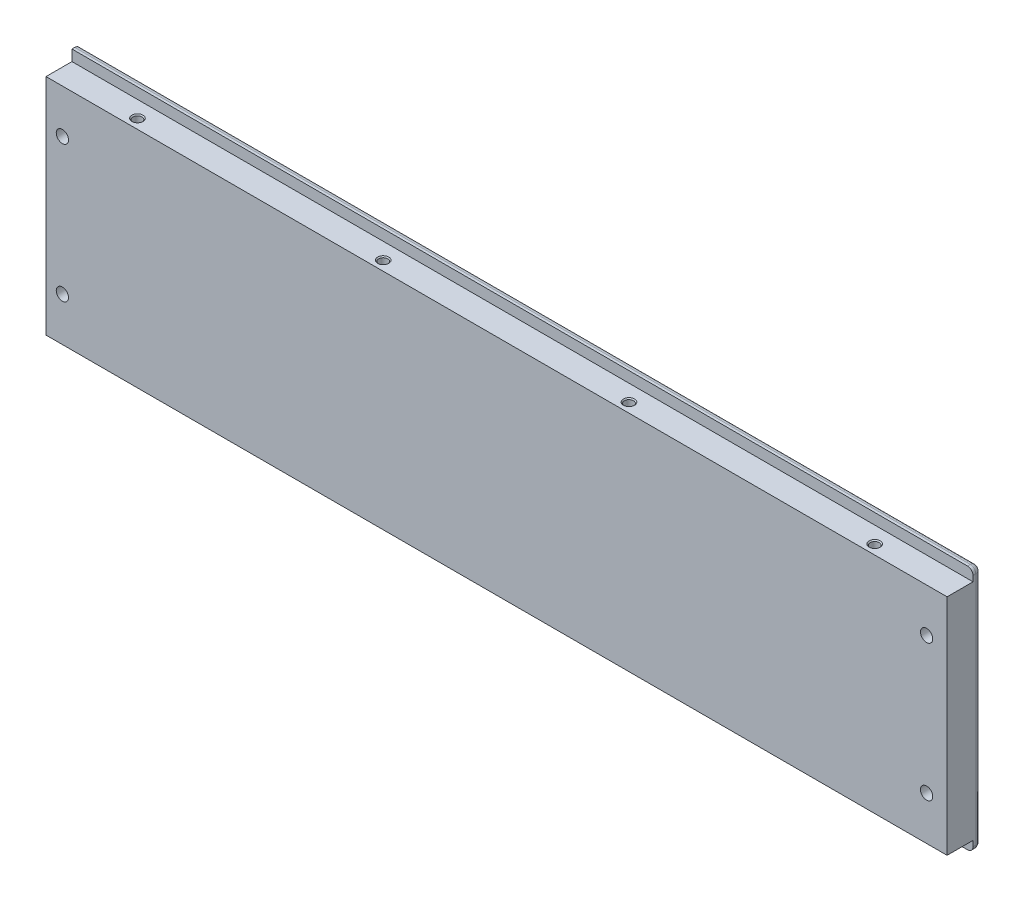
ISO-10303-21;
HEADER;
FILE_DESCRIPTION(('STEP AP214'),'2;1');
FILE_NAME('part.step','',(''),(''),'','','');
FILE_SCHEMA(('AUTOMOTIVE_DESIGN { 1 0 10303 214 1 1 1 1 }'));
ENDSEC;
DATA;
#1=APPLICATION_CONTEXT('core data for automotive mechanical design processes');
#2=APPLICATION_PROTOCOL_DEFINITION('international standard','automotive_design',2000,#1);
#3=PRODUCT_CONTEXT('',#1,'mechanical');
#4=PRODUCT('Part','Part','',(#3));
#5=PRODUCT_RELATED_PRODUCT_CATEGORY('part','',(#4));
#6=PRODUCT_DEFINITION_FORMATION('','',#4);
#7=PRODUCT_DEFINITION_CONTEXT('part definition',#1,'design');
#8=PRODUCT_DEFINITION('design','',#6,#7);
#9=PRODUCT_DEFINITION_SHAPE('','',#8);
#10=(LENGTH_UNIT() NAMED_UNIT(*) SI_UNIT(.MILLI.,.METRE.));
#11=(NAMED_UNIT(*) PLANE_ANGLE_UNIT() SI_UNIT($,.RADIAN.));
#12=(NAMED_UNIT(*) SI_UNIT($,.STERADIAN.) SOLID_ANGLE_UNIT());
#13=UNCERTAINTY_MEASURE_WITH_UNIT(LENGTH_MEASURE(1.E-05),#10,'distance_accuracy_value','');
#14=(GEOMETRIC_REPRESENTATION_CONTEXT(3) GLOBAL_UNCERTAINTY_ASSIGNED_CONTEXT((#13)) GLOBAL_UNIT_ASSIGNED_CONTEXT((#10,
#11,#12)) REPRESENTATION_CONTEXT('',''));
#15=CARTESIAN_POINT('',(0.,0.,0.));
#16=DIRECTION('',(0.,0.,1.));
#17=DIRECTION('',(1.,0.,0.));
#18=AXIS2_PLACEMENT_3D('',#15,#16,#17);
#19=CARTESIAN_POINT('',(330.,86.,12.5));
#20=DIRECTION('',(0.,-1.,0.));
#21=DIRECTION('',(0.,0.,-1.));
#22=AXIS2_PLACEMENT_3D('',#19,#20,#21);
#23=PLANE('',#22);
#24=CARTESIAN_POINT('',(30.,86.,9.));
#25=DIRECTION('',(0.,1.,0.));
#26=DIRECTION('',(0.,0.,1.));
#27=AXIS2_PLACEMENT_3D('',#24,#25,#26);
#28=CIRCLE('',#27,2.025);
#29=CARTESIAN_POINT('',(30.,86.,11.025));
#30=VERTEX_POINT('',#29);
#31=EDGE_CURVE('E251',#30,#30,#28,.T.);
#32=ORIENTED_EDGE('',*,*,#31,.F.);
#33=EDGE_LOOP('',(#32));
#34=FACE_BOUND('',#33,.T.);
#35=CARTESIAN_POINT('',(120.,86.,9.));
#36=DIRECTION('',(0.,1.,0.));
#37=DIRECTION('',(0.,0.,1.));
#38=AXIS2_PLACEMENT_3D('',#35,#36,#37);
#39=CIRCLE('',#38,2.025);
#40=CARTESIAN_POINT('',(120.,86.,11.025));
#41=VERTEX_POINT('',#40);
#42=EDGE_CURVE('E212',#41,#41,#39,.T.);
#43=ORIENTED_EDGE('',*,*,#42,.F.);
#44=EDGE_LOOP('',(#43));
#45=FACE_BOUND('',#44,.T.);
#46=DIRECTION('',(0.,0.,1.));
#47=VECTOR('',#46,1.);
#48=CARTESIAN_POINT('',(0.,86.,12.5));
#49=LINE('',#48,#47);
#50=CARTESIAN_POINT('',(0.,86.,3.));
#51=VERTEX_POINT('',#50);
#52=CARTESIAN_POINT('',(0.,86.,12.5));
#53=VERTEX_POINT('',#52);
#54=EDGE_CURVE('E171',#51,#53,#49,.T.);
#55=ORIENTED_EDGE('',*,*,#54,.T.);
#56=DIRECTION('',(-1.,0.,0.));
#57=VECTOR('',#56,1.);
#58=CARTESIAN_POINT('',(330.,86.,12.5));
#59=LINE('',#58,#57);
#60=CARTESIAN_POINT('',(330.,86.,12.5));
#61=VERTEX_POINT('',#60);
#62=EDGE_CURVE('E177',#61,#53,#59,.T.);
#63=ORIENTED_EDGE('',*,*,#62,.F.);
#64=DIRECTION('',(0.,0.,1.));
#65=VECTOR('',#64,1.);
#66=CARTESIAN_POINT('',(330.,86.,12.5));
#67=LINE('',#66,#65);
#68=CARTESIAN_POINT('',(330.,86.,3.));
#69=VERTEX_POINT('',#68);
#70=EDGE_CURVE('E170',#69,#61,#67,.T.);
#71=ORIENTED_EDGE('',*,*,#70,.F.);
#72=DIRECTION('',(-1.,0.,0.));
#73=VECTOR('',#72,1.);
#74=CARTESIAN_POINT('',(330.,86.,3.));
#75=LINE('',#74,#73);
#76=EDGE_CURVE('E181',#69,#51,#75,.T.);
#77=ORIENTED_EDGE('',*,*,#76,.T.);
#78=EDGE_LOOP('',(#55,#63,#71,#77));
#79=FACE_BOUND('',#78,.T.);
#80=CARTESIAN_POINT('',(300.,86.,9.));
#81=DIRECTION('',(0.,1.,0.));
#82=DIRECTION('',(0.,0.,1.));
#83=AXIS2_PLACEMENT_3D('',#80,#81,#82);
#84=CIRCLE('',#83,2.025);
#85=CARTESIAN_POINT('',(300.,86.,11.025));
#86=VERTEX_POINT('',#85);
#87=EDGE_CURVE('E202',#86,#86,#84,.T.);
#88=ORIENTED_EDGE('',*,*,#87,.F.);
#89=EDGE_LOOP('',(#88));
#90=FACE_BOUND('',#89,.T.);
#91=CARTESIAN_POINT('',(210.,86.,9.));
#92=DIRECTION('',(0.,1.,0.));
#93=DIRECTION('',(0.,0.,1.));
#94=AXIS2_PLACEMENT_3D('',#91,#92,#93);
#95=CIRCLE('',#94,2.025);
#96=CARTESIAN_POINT('',(210.,86.,11.025));
#97=VERTEX_POINT('',#96);
#98=EDGE_CURVE('E207',#97,#97,#95,.T.);
#99=ORIENTED_EDGE('',*,*,#98,.F.);
#100=EDGE_LOOP('',(#99));
#101=FACE_BOUND('',#100,.T.);
#102=ADVANCED_FACE('F36',(#34,#45,#79,#90,#101),#23,.F.);
#103=CARTESIAN_POINT('',(0.,0.,12.5));
#104=DIRECTION('',(1.,0.,0.));
#105=DIRECTION('',(0.,0.,-1.));
#106=AXIS2_PLACEMENT_3D('',#103,#104,#105);
#107=PLANE('',#106);
#108=DIRECTION('',(0.,0.,-1.));
#109=VECTOR('',#108,1.);
#110=CARTESIAN_POINT('',(0.,90.,12.5));
#111=LINE('',#110,#109);
#112=CARTESIAN_POINT('',(0.,90.,3.));
#113=VERTEX_POINT('',#112);
#114=CARTESIAN_POINT('',(0.,90.,2.));
#115=VERTEX_POINT('',#114);
#116=EDGE_CURVE('E188',#113,#115,#111,.T.);
#117=ORIENTED_EDGE('',*,*,#116,.T.);
#118=CARTESIAN_POINT('',(0.,88.,2.));
#119=DIRECTION('',(1.,0.,0.));
#120=DIRECTION('',(0.,0.,-1.));
#121=AXIS2_PLACEMENT_3D('',#118,#119,#120);
#122=CIRCLE('',#121,2.);
#123=CARTESIAN_POINT('',(0.,88.,0.));
#124=VERTEX_POINT('',#123);
#125=EDGE_CURVE('E45',#115,#124,#122,.F.);
#126=ORIENTED_EDGE('',*,*,#125,.T.);
#127=DIRECTION('',(0.,-1.,0.));
#128=VECTOR('',#127,1.);
#129=CARTESIAN_POINT('',(0.,0.,0.));
#130=LINE('',#129,#128);
#131=CARTESIAN_POINT('',(0.,2.,0.));
#132=VERTEX_POINT('',#131);
#133=EDGE_CURVE('E180',#124,#132,#130,.T.);
#134=ORIENTED_EDGE('',*,*,#133,.T.);
#135=CARTESIAN_POINT('',(0.,2.,2.));
#136=DIRECTION('',(1.,0.,0.));
#137=DIRECTION('',(0.,0.,-1.));
#138=AXIS2_PLACEMENT_3D('',#135,#136,#137);
#139=CIRCLE('',#138,2.);
#140=CARTESIAN_POINT('',(0.,0.,2.));
#141=VERTEX_POINT('',#140);
#142=EDGE_CURVE('E53',#132,#141,#139,.F.);
#143=ORIENTED_EDGE('',*,*,#142,.T.);
#144=DIRECTION('',(0.,0.,-1.));
#145=VECTOR('',#144,1.);
#146=CARTESIAN_POINT('',(0.,0.,12.5));
#147=LINE('',#146,#145);
#148=CARTESIAN_POINT('',(0.,0.,3.));
#149=VERTEX_POINT('',#148);
#150=EDGE_CURVE('E191',#149,#141,#147,.T.);
#151=ORIENTED_EDGE('',*,*,#150,.F.);
#152=DIRECTION('',(0.,-1.,0.));
#153=VECTOR('',#152,1.);
#154=CARTESIAN_POINT('',(0.,0.,3.));
#155=LINE('',#154,#153);
#156=CARTESIAN_POINT('',(0.,4.,3.));
#157=VERTEX_POINT('',#156);
#158=EDGE_CURVE('E157',#157,#149,#155,.T.);
#159=ORIENTED_EDGE('',*,*,#158,.F.);
#160=DIRECTION('',(0.,0.,-1.));
#161=VECTOR('',#160,1.);
#162=CARTESIAN_POINT('',(0.,4.,12.5));
#163=LINE('',#162,#161);
#164=CARTESIAN_POINT('',(0.,4.,12.5));
#165=VERTEX_POINT('',#164);
#166=EDGE_CURVE('E136',#165,#157,#163,.T.);
#167=ORIENTED_EDGE('',*,*,#166,.F.);
#168=DIRECTION('',(0.,-1.,0.));
#169=VECTOR('',#168,1.);
#170=CARTESIAN_POINT('',(0.,0.,12.5));
#171=LINE('',#170,#169);
#172=EDGE_CURVE('E184',#53,#165,#171,.T.);
#173=ORIENTED_EDGE('',*,*,#172,.F.);
#174=ORIENTED_EDGE('',*,*,#54,.F.);
#175=DIRECTION('',(0.,-1.,0.));
#176=VECTOR('',#175,1.);
#177=CARTESIAN_POINT('',(0.,90.,3.));
#178=LINE('',#177,#176);
#179=EDGE_CURVE('E165',#113,#51,#178,.T.);
#180=ORIENTED_EDGE('',*,*,#179,.F.);
#181=EDGE_LOOP('',(#117,#126,#134,#143,#151,#159,#167,#173,#174,#180));
#182=FACE_BOUND('',#181,.T.);
#183=ADVANCED_FACE('F327',(#182),#107,.F.);
#184=CARTESIAN_POINT('',(0.,0.,12.5));
#185=DIRECTION('',(0.,1.,0.));
#186=DIRECTION('',(0.,0.,1.));
#187=AXIS2_PLACEMENT_3D('',#184,#185,#186);
#188=PLANE('',#187);
#189=ORIENTED_EDGE('',*,*,#150,.T.);
#190=DIRECTION('',(1.,0.,0.));
#191=VECTOR('',#190,1.);
#192=CARTESIAN_POINT('',(328.,0.,2.));
#193=LINE('',#192,#191);
#194=CARTESIAN_POINT('',(328.,0.,2.));
#195=VERTEX_POINT('',#194);
#196=EDGE_CURVE('E11',#141,#195,#193,.T.);
#197=ORIENTED_EDGE('',*,*,#196,.T.);
#198=DIRECTION('',(0.,0.,-1.));
#199=VECTOR('',#198,1.);
#200=CARTESIAN_POINT('',(328.,0.,12.5));
#201=LINE('',#200,#199);
#202=CARTESIAN_POINT('',(328.,0.,3.));
#203=VERTEX_POINT('',#202);
#204=EDGE_CURVE('E221',#195,#203,#201,.F.);
#205=ORIENTED_EDGE('',*,*,#204,.T.);
#206=DIRECTION('',(-1.,0.,0.));
#207=VECTOR('',#206,1.);
#208=CARTESIAN_POINT('',(330.,0.,3.));
#209=LINE('',#208,#207);
#210=EDGE_CURVE('E140',#203,#149,#209,.T.);
#211=ORIENTED_EDGE('',*,*,#210,.T.);
#212=EDGE_LOOP('',(#189,#197,#205,#211));
#213=FACE_BOUND('',#212,.T.);
#214=ADVANCED_FACE('F333',(#213),#188,.F.);
#215=CARTESIAN_POINT('',(330.,0.,12.5));
#216=DIRECTION('',(-1.,0.,0.));
#217=DIRECTION('',(0.,0.,1.));
#218=AXIS2_PLACEMENT_3D('',#215,#216,#217);
#219=PLANE('',#218);
#220=DIRECTION('',(0.,0.,-1.));
#221=VECTOR('',#220,1.);
#222=CARTESIAN_POINT('',(330.,2.,12.5));
#223=LINE('',#222,#221);
#224=CARTESIAN_POINT('',(330.,2.,3.));
#225=VERTEX_POINT('',#224);
#226=CARTESIAN_POINT('',(330.,2.,2.));
#227=VERTEX_POINT('',#226);
#228=EDGE_CURVE('E215',#225,#227,#223,.T.);
#229=ORIENTED_EDGE('',*,*,#228,.T.);
#230=DIRECTION('',(0.,1.,0.));
#231=VECTOR('',#230,1.);
#232=CARTESIAN_POINT('',(330.,88.,2.));
#233=LINE('',#232,#231);
#234=CARTESIAN_POINT('',(330.,88.,2.));
#235=VERTEX_POINT('',#234);
#236=EDGE_CURVE('E227',#227,#235,#233,.T.);
#237=ORIENTED_EDGE('',*,*,#236,.T.);
#238=DIRECTION('',(0.,0.,-1.));
#239=VECTOR('',#238,1.);
#240=CARTESIAN_POINT('',(330.,88.,12.5));
#241=LINE('',#240,#239);
#242=CARTESIAN_POINT('',(330.,88.,3.));
#243=VERTEX_POINT('',#242);
#244=EDGE_CURVE('E217',#235,#243,#241,.F.);
#245=ORIENTED_EDGE('',*,*,#244,.T.);
#246=DIRECTION('',(0.,-1.,0.));
#247=VECTOR('',#246,1.);
#248=CARTESIAN_POINT('',(330.,90.,3.));
#249=LINE('',#248,#247);
#250=EDGE_CURVE('E168',#243,#69,#249,.T.);
#251=ORIENTED_EDGE('',*,*,#250,.T.);
#252=ORIENTED_EDGE('',*,*,#70,.T.);
#253=DIRECTION('',(0.,1.,0.));
#254=VECTOR('',#253,1.);
#255=CARTESIAN_POINT('',(330.,0.,12.5));
#256=LINE('',#255,#254);
#257=CARTESIAN_POINT('',(330.,4.,12.5));
#258=VERTEX_POINT('',#257);
#259=EDGE_CURVE('E156',#258,#61,#256,.T.);
#260=ORIENTED_EDGE('',*,*,#259,.F.);
#261=DIRECTION('',(0.,0.,-1.));
#262=VECTOR('',#261,1.);
#263=CARTESIAN_POINT('',(330.,4.,12.5));
#264=LINE('',#263,#262);
#265=CARTESIAN_POINT('',(330.,4.,3.));
#266=VERTEX_POINT('',#265);
#267=EDGE_CURVE('E133',#258,#266,#264,.T.);
#268=ORIENTED_EDGE('',*,*,#267,.T.);
#269=DIRECTION('',(0.,-1.,0.));
#270=VECTOR('',#269,1.);
#271=CARTESIAN_POINT('',(330.,0.,3.));
#272=LINE('',#271,#270);
#273=EDGE_CURVE('E144',#266,#225,#272,.T.);
#274=ORIENTED_EDGE('',*,*,#273,.T.);
#275=EDGE_LOOP('',(#229,#237,#245,#251,#252,#260,#268,#274));
#276=FACE_BOUND('',#275,.T.);
#277=ADVANCED_FACE('F154',(#276),#219,.F.);
#278=CARTESIAN_POINT('',(0.,90.,12.5));
#279=DIRECTION('',(0.,-1.,0.));
#280=DIRECTION('',(0.,0.,-1.));
#281=AXIS2_PLACEMENT_3D('',#278,#279,#280);
#282=PLANE('',#281);
#283=DIRECTION('',(0.,0.,-1.));
#284=VECTOR('',#283,1.);
#285=CARTESIAN_POINT('',(328.,90.,12.5));
#286=LINE('',#285,#284);
#287=CARTESIAN_POINT('',(328.,90.,3.));
#288=VERTEX_POINT('',#287);
#289=CARTESIAN_POINT('',(328.,90.,2.));
#290=VERTEX_POINT('',#289);
#291=EDGE_CURVE('E193',#288,#290,#286,.T.);
#292=ORIENTED_EDGE('',*,*,#291,.T.);
#293=DIRECTION('',(-1.,0.,0.));
#294=VECTOR('',#293,1.);
#295=CARTESIAN_POINT('',(0.,90.,2.));
#296=LINE('',#295,#294);
#297=EDGE_CURVE('E61',#290,#115,#296,.T.);
#298=ORIENTED_EDGE('',*,*,#297,.T.);
#299=ORIENTED_EDGE('',*,*,#116,.F.);
#300=DIRECTION('',(-1.,0.,0.));
#301=VECTOR('',#300,1.);
#302=CARTESIAN_POINT('',(330.,90.,3.));
#303=LINE('',#302,#301);
#304=EDGE_CURVE('E173',#288,#113,#303,.T.);
#305=ORIENTED_EDGE('',*,*,#304,.F.);
#306=EDGE_LOOP('',(#292,#298,#299,#305));
#307=FACE_BOUND('',#306,.T.);
#308=ADVANCED_FACE('F344',(#307),#282,.F.);
#309=CARTESIAN_POINT('',(0.,0.,12.5));
#310=DIRECTION('',(0.,0.,-1.));
#311=DIRECTION('',(-1.,0.,0.));
#312=AXIS2_PLACEMENT_3D('',#309,#310,#311);
#313=PLANE('',#312);
#314=CARTESIAN_POINT('',(322.5,70.,12.5));
#315=DIRECTION('',(0.,0.,-1.));
#316=DIRECTION('',(-1.,0.,0.));
#317=AXIS2_PLACEMENT_3D('',#314,#315,#316);
#318=CIRCLE('',#317,2.24999999999997);
#319=CARTESIAN_POINT('',(320.25,70.,12.5));
#320=VERTEX_POINT('',#319);
#321=EDGE_CURVE('E279',#320,#320,#318,.T.);
#322=ORIENTED_EDGE('',*,*,#321,.T.);
#323=EDGE_LOOP('',(#322));
#324=FACE_BOUND('',#323,.T.);
#325=CARTESIAN_POINT('',(322.5,20.,12.5));
#326=DIRECTION('',(0.,0.,-1.));
#327=DIRECTION('',(-1.,0.,0.));
#328=AXIS2_PLACEMENT_3D('',#325,#326,#327);
#329=CIRCLE('',#328,2.24999999999997);
#330=CARTESIAN_POINT('',(320.25,20.,12.5));
#331=VERTEX_POINT('',#330);
#332=EDGE_CURVE('E288',#331,#331,#329,.T.);
#333=ORIENTED_EDGE('',*,*,#332,.T.);
#334=EDGE_LOOP('',(#333));
#335=FACE_BOUND('',#334,.T.);
#336=CARTESIAN_POINT('',(6.,70.,12.5));
#337=DIRECTION('',(0.,0.,-1.));
#338=DIRECTION('',(-1.,0.,0.));
#339=AXIS2_PLACEMENT_3D('',#336,#337,#338);
#340=CIRCLE('',#339,2.25);
#341=CARTESIAN_POINT('',(3.75,70.,12.5));
#342=VERTEX_POINT('',#341);
#343=EDGE_CURVE('E297',#342,#342,#340,.T.);
#344=ORIENTED_EDGE('',*,*,#343,.T.);
#345=EDGE_LOOP('',(#344));
#346=FACE_BOUND('',#345,.T.);
#347=CARTESIAN_POINT('',(6.,20.,12.5));
#348=DIRECTION('',(0.,0.,-1.));
#349=DIRECTION('',(-1.,0.,0.));
#350=AXIS2_PLACEMENT_3D('',#347,#348,#349);
#351=CIRCLE('',#350,2.25);
#352=CARTESIAN_POINT('',(3.75,20.,12.5));
#353=VERTEX_POINT('',#352);
#354=EDGE_CURVE('E161',#353,#353,#351,.T.);
#355=ORIENTED_EDGE('',*,*,#354,.T.);
#356=EDGE_LOOP('',(#355));
#357=FACE_BOUND('',#356,.T.);
#358=ORIENTED_EDGE('',*,*,#172,.T.);
#359=DIRECTION('',(-1.,0.,0.));
#360=VECTOR('',#359,1.);
#361=CARTESIAN_POINT('',(330.,4.,12.5));
#362=LINE('',#361,#360);
#363=EDGE_CURVE('E141',#258,#165,#362,.T.);
#364=ORIENTED_EDGE('',*,*,#363,.F.);
#365=ORIENTED_EDGE('',*,*,#259,.T.);
#366=ORIENTED_EDGE('',*,*,#62,.T.);
#367=EDGE_LOOP('',(#358,#364,#365,#366));
#368=FACE_BOUND('',#367,.T.);
#369=ADVANCED_FACE('F309',(#324,#335,#346,#357,#368),#313,.F.);
#370=CARTESIAN_POINT('',(0.,0.,0.));
#371=DIRECTION('',(0.,0.,-1.));
#372=DIRECTION('',(-1.,0.,0.));
#373=AXIS2_PLACEMENT_3D('',#370,#371,#372);
#374=PLANE('',#373);
#375=CARTESIAN_POINT('',(322.5,70.,0.));
#376=DIRECTION('',(0.,0.,-1.));
#377=DIRECTION('',(-1.,0.,0.));
#378=AXIS2_PLACEMENT_3D('',#375,#376,#377);
#379=CIRCLE('',#378,4.47999999999998);
#380=CARTESIAN_POINT('',(318.02,70.,0.));
#381=VERTEX_POINT('',#380);
#382=EDGE_CURVE('E197',#381,#381,#379,.T.);
#383=ORIENTED_EDGE('',*,*,#382,.F.);
#384=EDGE_LOOP('',(#383));
#385=FACE_BOUND('',#384,.T.);
#386=CARTESIAN_POINT('',(322.5,20.,0.));
#387=DIRECTION('',(0.,0.,-1.));
#388=DIRECTION('',(-1.,0.,0.));
#389=AXIS2_PLACEMENT_3D('',#386,#387,#388);
#390=CIRCLE('',#389,4.47999999999998);
#391=CARTESIAN_POINT('',(318.02,20.,0.));
#392=VERTEX_POINT('',#391);
#393=EDGE_CURVE('E282',#392,#392,#390,.T.);
#394=ORIENTED_EDGE('',*,*,#393,.F.);
#395=EDGE_LOOP('',(#394));
#396=FACE_BOUND('',#395,.T.);
#397=CARTESIAN_POINT('',(6.,70.,0.));
#398=DIRECTION('',(0.,0.,-1.));
#399=DIRECTION('',(-1.,0.,0.));
#400=AXIS2_PLACEMENT_3D('',#397,#398,#399);
#401=CIRCLE('',#400,4.48);
#402=CARTESIAN_POINT('',(1.52,70.,0.));
#403=VERTEX_POINT('',#402);
#404=EDGE_CURVE('E291',#403,#403,#401,.T.);
#405=ORIENTED_EDGE('',*,*,#404,.F.);
#406=EDGE_LOOP('',(#405));
#407=FACE_BOUND('',#406,.T.);
#408=CARTESIAN_POINT('',(6.,20.,0.));
#409=DIRECTION('',(0.,0.,-1.));
#410=DIRECTION('',(-1.,0.,0.));
#411=AXIS2_PLACEMENT_3D('',#408,#409,#410);
#412=CIRCLE('',#411,4.48);
#413=CARTESIAN_POINT('',(1.52,20.,0.));
#414=VERTEX_POINT('',#413);
#415=EDGE_CURVE('E300',#414,#414,#412,.T.);
#416=ORIENTED_EDGE('',*,*,#415,.F.);
#417=EDGE_LOOP('',(#416));
#418=FACE_BOUND('',#417,.T.);
#419=ORIENTED_EDGE('',*,*,#133,.F.);
#420=DIRECTION('',(-1.,0.,0.));
#421=VECTOR('',#420,1.);
#422=CARTESIAN_POINT('',(328.,88.,0.));
#423=LINE('',#422,#421);
#424=CARTESIAN_POINT('',(328.,88.,0.));
#425=VERTEX_POINT('',#424);
#426=EDGE_CURVE('E233',#124,#425,#423,.F.);
#427=ORIENTED_EDGE('',*,*,#426,.T.);
#428=DIRECTION('',(0.,1.,0.));
#429=VECTOR('',#428,1.);
#430=CARTESIAN_POINT('',(328.,2.,0.));
#431=LINE('',#430,#429);
#432=CARTESIAN_POINT('',(328.,2.,0.));
#433=VERTEX_POINT('',#432);
#434=EDGE_CURVE('E231',#425,#433,#431,.F.);
#435=ORIENTED_EDGE('',*,*,#434,.T.);
#436=DIRECTION('',(1.,0.,0.));
#437=VECTOR('',#436,1.);
#438=CARTESIAN_POINT('',(0.,2.,0.));
#439=LINE('',#438,#437);
#440=EDGE_CURVE('E229',#433,#132,#439,.F.);
#441=ORIENTED_EDGE('',*,*,#440,.T.);
#442=EDGE_LOOP('',(#419,#427,#435,#441));
#443=FACE_BOUND('',#442,.T.);
#444=ADVANCED_FACE('F340',(#385,#396,#407,#418,#443),#374,.T.);
#445=CARTESIAN_POINT('',(330.,90.,3.));
#446=DIRECTION('',(0.,0.,-1.));
#447=DIRECTION('',(-1.,0.,0.));
#448=AXIS2_PLACEMENT_3D('',#445,#446,#447);
#449=PLANE('',#448);
#450=ORIENTED_EDGE('',*,*,#250,.F.);
#451=CARTESIAN_POINT('',(328.,88.,3.));
#452=DIRECTION('',(0.,0.,-1.));
#453=DIRECTION('',(-1.,0.,0.));
#454=AXIS2_PLACEMENT_3D('',#451,#452,#453);
#455=CIRCLE('',#454,2.);
#456=EDGE_CURVE('E219',#243,#288,#455,.F.);
#457=ORIENTED_EDGE('',*,*,#456,.T.);
#458=ORIENTED_EDGE('',*,*,#304,.T.);
#459=ORIENTED_EDGE('',*,*,#179,.T.);
#460=ORIENTED_EDGE('',*,*,#76,.F.);
#461=EDGE_LOOP('',(#450,#457,#458,#459,#460));
#462=FACE_BOUND('',#461,.T.);
#463=ADVANCED_FACE('F337',(#462),#449,.F.);
#464=CARTESIAN_POINT('',(330.,0.,3.));
#465=DIRECTION('',(0.,0.,-1.));
#466=DIRECTION('',(-1.,0.,0.));
#467=AXIS2_PLACEMENT_3D('',#464,#465,#466);
#468=PLANE('',#467);
#469=ORIENTED_EDGE('',*,*,#210,.F.);
#470=CARTESIAN_POINT('',(328.,2.,3.));
#471=DIRECTION('',(0.,0.,-1.));
#472=DIRECTION('',(-1.,0.,0.));
#473=AXIS2_PLACEMENT_3D('',#470,#471,#472);
#474=CIRCLE('',#473,2.);
#475=EDGE_CURVE('E148',#203,#225,#474,.F.);
#476=ORIENTED_EDGE('',*,*,#475,.T.);
#477=ORIENTED_EDGE('',*,*,#273,.F.);
#478=DIRECTION('',(-1.,0.,0.));
#479=VECTOR('',#478,1.);
#480=CARTESIAN_POINT('',(330.,4.,3.));
#481=LINE('',#480,#479);
#482=EDGE_CURVE('E129',#266,#157,#481,.T.);
#483=ORIENTED_EDGE('',*,*,#482,.T.);
#484=ORIENTED_EDGE('',*,*,#158,.T.);
#485=EDGE_LOOP('',(#469,#476,#477,#483,#484));
#486=FACE_BOUND('',#485,.T.);
#487=ADVANCED_FACE('F146',(#486),#468,.F.);
#488=CARTESIAN_POINT('',(330.,4.,12.5));
#489=DIRECTION('',(0.,1.,0.));
#490=DIRECTION('',(0.,0.,1.));
#491=AXIS2_PLACEMENT_3D('',#488,#489,#490);
#492=PLANE('',#491);
#493=CARTESIAN_POINT('',(30.,4.,9.));
#494=DIRECTION('',(0.,1.,0.));
#495=DIRECTION('',(0.,0.,1.));
#496=AXIS2_PLACEMENT_3D('',#493,#494,#495);
#497=CIRCLE('',#496,1.64999999999998);
#498=CARTESIAN_POINT('',(30.,4.,10.65));
#499=VERTEX_POINT('',#498);
#500=EDGE_CURVE('E209',#499,#499,#497,.T.);
#501=ORIENTED_EDGE('',*,*,#500,.T.);
#502=EDGE_LOOP('',(#501));
#503=FACE_BOUND('',#502,.T.);
#504=CARTESIAN_POINT('',(120.,4.,9.));
#505=DIRECTION('',(0.,1.,0.));
#506=DIRECTION('',(0.,0.,1.));
#507=AXIS2_PLACEMENT_3D('',#504,#505,#506);
#508=CIRCLE('',#507,1.64999999999998);
#509=CARTESIAN_POINT('',(120.,4.,10.65));
#510=VERTEX_POINT('',#509);
#511=EDGE_CURVE('E204',#510,#510,#508,.T.);
#512=ORIENTED_EDGE('',*,*,#511,.T.);
#513=EDGE_LOOP('',(#512));
#514=FACE_BOUND('',#513,.T.);
#515=CARTESIAN_POINT('',(210.,4.,9.));
#516=DIRECTION('',(0.,1.,0.));
#517=DIRECTION('',(0.,0.,1.));
#518=AXIS2_PLACEMENT_3D('',#515,#516,#517);
#519=CIRCLE('',#518,1.64999999999998);
#520=CARTESIAN_POINT('',(210.,4.,10.65));
#521=VERTEX_POINT('',#520);
#522=EDGE_CURVE('E199',#521,#521,#519,.T.);
#523=ORIENTED_EDGE('',*,*,#522,.T.);
#524=EDGE_LOOP('',(#523));
#525=FACE_BOUND('',#524,.T.);
#526=CARTESIAN_POINT('',(300.,4.,9.));
#527=DIRECTION('',(0.,1.,0.));
#528=DIRECTION('',(0.,0.,1.));
#529=AXIS2_PLACEMENT_3D('',#526,#527,#528);
#530=CIRCLE('',#529,1.64999999999998);
#531=CARTESIAN_POINT('',(300.,4.,10.65));
#532=VERTEX_POINT('',#531);
#533=EDGE_CURVE('E194',#532,#532,#530,.T.);
#534=ORIENTED_EDGE('',*,*,#533,.T.);
#535=EDGE_LOOP('',(#534));
#536=FACE_BOUND('',#535,.T.);
#537=ORIENTED_EDGE('',*,*,#166,.T.);
#538=ORIENTED_EDGE('',*,*,#482,.F.);
#539=ORIENTED_EDGE('',*,*,#267,.F.);
#540=ORIENTED_EDGE('',*,*,#363,.T.);
#541=EDGE_LOOP('',(#537,#538,#539,#540));
#542=FACE_BOUND('',#541,.T.);
#543=ADVANCED_FACE('F131',(#503,#514,#525,#536,#542),#492,.F.);
#544=CARTESIAN_POINT('',(6.,20.,0.));
#545=DIRECTION('',(0.,0.,-1.));
#546=DIRECTION('',(-1.,0.,0.));
#547=AXIS2_PLACEMENT_3D('',#544,#545,#546);
#548=CYLINDRICAL_SURFACE('',#547,2.25);
#549=ORIENTED_EDGE('',*,*,#354,.F.);
#550=EDGE_LOOP('',(#549));
#551=FACE_BOUND('',#550,.T.);
#552=CARTESIAN_POINT('',(6.,20.,2.23));
#553=DIRECTION('',(0.,0.,-1.));
#554=DIRECTION('',(-1.,0.,0.));
#555=AXIS2_PLACEMENT_3D('',#552,#553,#554);
#556=CIRCLE('',#555,2.25);
#557=CARTESIAN_POINT('',(3.75,20.,2.23));
#558=VERTEX_POINT('',#557);
#559=EDGE_CURVE('E302',#558,#558,#556,.T.);
#560=ORIENTED_EDGE('',*,*,#559,.T.);
#561=EDGE_LOOP('',(#560));
#562=FACE_BOUND('',#561,.T.);
#563=ADVANCED_FACE('F312',(#551,#562),#548,.F.);
#564=CARTESIAN_POINT('',(6.,20.,0.));
#565=DIRECTION('',(0.,0.,-1.));
#566=DIRECTION('',(-1.,0.,0.));
#567=AXIS2_PLACEMENT_3D('',#564,#565,#566);
#568=CONICAL_SURFACE('',#567,4.48,0.785398163397448);
#569=ORIENTED_EDGE('',*,*,#559,.F.);
#570=EDGE_LOOP('',(#569));
#571=FACE_BOUND('',#570,.T.);
#572=ORIENTED_EDGE('',*,*,#415,.T.);
#573=EDGE_LOOP('',(#572));
#574=FACE_BOUND('',#573,.T.);
#575=ADVANCED_FACE('F314',(#571,#574),#568,.F.);
#576=CARTESIAN_POINT('',(6.,70.,0.));
#577=DIRECTION('',(0.,0.,-1.));
#578=DIRECTION('',(-1.,0.,0.));
#579=AXIS2_PLACEMENT_3D('',#576,#577,#578);
#580=CYLINDRICAL_SURFACE('',#579,2.25);
#581=ORIENTED_EDGE('',*,*,#343,.F.);
#582=EDGE_LOOP('',(#581));
#583=FACE_BOUND('',#582,.T.);
#584=CARTESIAN_POINT('',(6.,70.,2.23));
#585=DIRECTION('',(0.,0.,-1.));
#586=DIRECTION('',(-1.,0.,0.));
#587=AXIS2_PLACEMENT_3D('',#584,#585,#586);
#588=CIRCLE('',#587,2.25);
#589=CARTESIAN_POINT('',(3.75,70.,2.23));
#590=VERTEX_POINT('',#589);
#591=EDGE_CURVE('E294',#590,#590,#588,.T.);
#592=ORIENTED_EDGE('',*,*,#591,.T.);
#593=EDGE_LOOP('',(#592));
#594=FACE_BOUND('',#593,.T.);
#595=ADVANCED_FACE('F320',(#583,#594),#580,.F.);
#596=CARTESIAN_POINT('',(6.,70.,0.));
#597=DIRECTION('',(0.,0.,-1.));
#598=DIRECTION('',(-1.,0.,0.));
#599=AXIS2_PLACEMENT_3D('',#596,#597,#598);
#600=CONICAL_SURFACE('',#599,4.48,0.785398163397448);
#601=ORIENTED_EDGE('',*,*,#591,.F.);
#602=EDGE_LOOP('',(#601));
#603=FACE_BOUND('',#602,.T.);
#604=ORIENTED_EDGE('',*,*,#404,.T.);
#605=EDGE_LOOP('',(#604));
#606=FACE_BOUND('',#605,.T.);
#607=ADVANCED_FACE('F451',(#603,#606),#600,.F.);
#608=CARTESIAN_POINT('',(322.5,20.,0.));
#609=DIRECTION('',(0.,0.,-1.));
#610=DIRECTION('',(-1.,0.,0.));
#611=AXIS2_PLACEMENT_3D('',#608,#609,#610);
#612=CYLINDRICAL_SURFACE('',#611,2.24999999999997);
#613=ORIENTED_EDGE('',*,*,#332,.F.);
#614=EDGE_LOOP('',(#613));
#615=FACE_BOUND('',#614,.T.);
#616=CARTESIAN_POINT('',(322.5,20.,2.23));
#617=DIRECTION('',(0.,0.,-1.));
#618=DIRECTION('',(-1.,0.,0.));
#619=AXIS2_PLACEMENT_3D('',#616,#617,#618);
#620=CIRCLE('',#619,2.24999999999997);
#621=CARTESIAN_POINT('',(320.25,20.,2.23));
#622=VERTEX_POINT('',#621);
#623=EDGE_CURVE('E285',#622,#622,#620,.T.);
#624=ORIENTED_EDGE('',*,*,#623,.T.);
#625=EDGE_LOOP('',(#624));
#626=FACE_BOUND('',#625,.T.);
#627=ADVANCED_FACE('F447',(#615,#626),#612,.F.);
#628=CARTESIAN_POINT('',(322.5,20.,0.));
#629=DIRECTION('',(0.,0.,-1.));
#630=DIRECTION('',(-1.,0.,0.));
#631=AXIS2_PLACEMENT_3D('',#628,#629,#630);
#632=CONICAL_SURFACE('',#631,4.47999999999998,0.78539816339745);
#633=ORIENTED_EDGE('',*,*,#623,.F.);
#634=EDGE_LOOP('',(#633));
#635=FACE_BOUND('',#634,.T.);
#636=ORIENTED_EDGE('',*,*,#393,.T.);
#637=EDGE_LOOP('',(#636));
#638=FACE_BOUND('',#637,.T.);
#639=ADVANCED_FACE('F443',(#635,#638),#632,.F.);
#640=CARTESIAN_POINT('',(322.5,70.,0.));
#641=DIRECTION('',(0.,0.,-1.));
#642=DIRECTION('',(-1.,0.,0.));
#643=AXIS2_PLACEMENT_3D('',#640,#641,#642);
#644=CYLINDRICAL_SURFACE('',#643,2.24999999999997);
#645=ORIENTED_EDGE('',*,*,#321,.F.);
#646=EDGE_LOOP('',(#645));
#647=FACE_BOUND('',#646,.T.);
#648=CARTESIAN_POINT('',(322.5,70.,2.23));
#649=DIRECTION('',(0.,0.,-1.));
#650=DIRECTION('',(-1.,0.,0.));
#651=AXIS2_PLACEMENT_3D('',#648,#649,#650);
#652=CIRCLE('',#651,2.24999999999997);
#653=CARTESIAN_POINT('',(320.25,70.,2.23));
#654=VERTEX_POINT('',#653);
#655=EDGE_CURVE('E276',#654,#654,#652,.T.);
#656=ORIENTED_EDGE('',*,*,#655,.T.);
#657=EDGE_LOOP('',(#656));
#658=FACE_BOUND('',#657,.T.);
#659=ADVANCED_FACE('F439',(#647,#658),#644,.F.);
#660=CARTESIAN_POINT('',(322.5,70.,0.));
#661=DIRECTION('',(0.,0.,-1.));
#662=DIRECTION('',(-1.,0.,0.));
#663=AXIS2_PLACEMENT_3D('',#660,#661,#662);
#664=CONICAL_SURFACE('',#663,4.47999999999998,0.78539816339745);
#665=ORIENTED_EDGE('',*,*,#655,.F.);
#666=EDGE_LOOP('',(#665));
#667=FACE_BOUND('',#666,.T.);
#668=ORIENTED_EDGE('',*,*,#382,.T.);
#669=EDGE_LOOP('',(#668));
#670=FACE_BOUND('',#669,.T.);
#671=ADVANCED_FACE('F435',(#667,#670),#664,.F.);
#672=CARTESIAN_POINT('',(300.,86.,9.));
#673=DIRECTION('',(0.,1.,0.));
#674=DIRECTION('',(0.,0.,1.));
#675=AXIS2_PLACEMENT_3D('',#672,#673,#674);
#676=CYLINDRICAL_SURFACE('',#675,1.64999999999998);
#677=CARTESIAN_POINT('',(300.,85.625,9.));
#678=DIRECTION('',(0.,1.,0.));
#679=DIRECTION('',(0.,0.,1.));
#680=AXIS2_PLACEMENT_3D('',#677,#678,#679);
#681=CIRCLE('',#680,1.64999999999998);
#682=CARTESIAN_POINT('',(300.,85.625,10.65));
#683=VERTEX_POINT('',#682);
#684=EDGE_CURVE('E198',#683,#683,#681,.T.);
#685=ORIENTED_EDGE('',*,*,#684,.T.);
#686=EDGE_LOOP('',(#685));
#687=FACE_BOUND('',#686,.T.);
#688=ORIENTED_EDGE('',*,*,#533,.F.);
#689=EDGE_LOOP('',(#688));
#690=FACE_BOUND('',#689,.T.);
#691=ADVANCED_FACE('F431',(#687,#690),#676,.F.);
#692=CARTESIAN_POINT('',(300.,86.,9.));
#693=DIRECTION('',(0.,1.,0.));
#694=DIRECTION('',(0.,0.,1.));
#695=AXIS2_PLACEMENT_3D('',#692,#693,#694);
#696=CONICAL_SURFACE('',#695,2.025,0.785398163397467);
#697=ORIENTED_EDGE('',*,*,#684,.F.);
#698=EDGE_LOOP('',(#697));
#699=FACE_BOUND('',#698,.T.);
#700=ORIENTED_EDGE('',*,*,#87,.T.);
#701=EDGE_LOOP('',(#700));
#702=FACE_BOUND('',#701,.T.);
#703=ADVANCED_FACE('F423',(#699,#702),#696,.F.);
#704=CARTESIAN_POINT('',(210.,86.,9.));
#705=DIRECTION('',(0.,1.,0.));
#706=DIRECTION('',(0.,0.,1.));
#707=AXIS2_PLACEMENT_3D('',#704,#705,#706);
#708=CYLINDRICAL_SURFACE('',#707,1.64999999999998);
#709=CARTESIAN_POINT('',(210.,85.625,9.));
#710=DIRECTION('',(0.,1.,0.));
#711=DIRECTION('',(0.,0.,1.));
#712=AXIS2_PLACEMENT_3D('',#709,#710,#711);
#713=CIRCLE('',#712,1.64999999999998);
#714=CARTESIAN_POINT('',(210.,85.625,10.65));
#715=VERTEX_POINT('',#714);
#716=EDGE_CURVE('E203',#715,#715,#713,.T.);
#717=ORIENTED_EDGE('',*,*,#716,.T.);
#718=EDGE_LOOP('',(#717));
#719=FACE_BOUND('',#718,.T.);
#720=ORIENTED_EDGE('',*,*,#522,.F.);
#721=EDGE_LOOP('',(#720));
#722=FACE_BOUND('',#721,.T.);
#723=ADVANCED_FACE('F413',(#719,#722),#708,.F.);
#724=CARTESIAN_POINT('',(210.,86.,9.));
#725=DIRECTION('',(0.,1.,0.));
#726=DIRECTION('',(0.,0.,1.));
#727=AXIS2_PLACEMENT_3D('',#724,#725,#726);
#728=CONICAL_SURFACE('',#727,2.025,0.785398163397467);
#729=ORIENTED_EDGE('',*,*,#716,.F.);
#730=EDGE_LOOP('',(#729));
#731=FACE_BOUND('',#730,.T.);
#732=ORIENTED_EDGE('',*,*,#98,.T.);
#733=EDGE_LOOP('',(#732));
#734=FACE_BOUND('',#733,.T.);
#735=ADVANCED_FACE('F410',(#731,#734),#728,.F.);
#736=CARTESIAN_POINT('',(120.,86.,9.));
#737=DIRECTION('',(0.,1.,0.));
#738=DIRECTION('',(0.,0.,1.));
#739=AXIS2_PLACEMENT_3D('',#736,#737,#738);
#740=CYLINDRICAL_SURFACE('',#739,1.64999999999998);
#741=CARTESIAN_POINT('',(120.,85.625,9.));
#742=DIRECTION('',(0.,1.,0.));
#743=DIRECTION('',(0.,0.,1.));
#744=AXIS2_PLACEMENT_3D('',#741,#742,#743);
#745=CIRCLE('',#744,1.64999999999998);
#746=CARTESIAN_POINT('',(120.,85.625,10.65));
#747=VERTEX_POINT('',#746);
#748=EDGE_CURVE('E208',#747,#747,#745,.T.);
#749=ORIENTED_EDGE('',*,*,#748,.T.);
#750=EDGE_LOOP('',(#749));
#751=FACE_BOUND('',#750,.T.);
#752=ORIENTED_EDGE('',*,*,#511,.F.);
#753=EDGE_LOOP('',(#752));
#754=FACE_BOUND('',#753,.T.);
#755=ADVANCED_FACE('F412',(#751,#754),#740,.F.);
#756=CARTESIAN_POINT('',(120.,86.,9.));
#757=DIRECTION('',(0.,1.,0.));
#758=DIRECTION('',(0.,0.,1.));
#759=AXIS2_PLACEMENT_3D('',#756,#757,#758);
#760=CONICAL_SURFACE('',#759,2.025,0.785398163397467);
#761=ORIENTED_EDGE('',*,*,#748,.F.);
#762=EDGE_LOOP('',(#761));
#763=FACE_BOUND('',#762,.T.);
#764=ORIENTED_EDGE('',*,*,#42,.T.);
#765=EDGE_LOOP('',(#764));
#766=FACE_BOUND('',#765,.T.);
#767=ADVANCED_FACE('F420',(#763,#766),#760,.F.);
#768=CARTESIAN_POINT('',(30.,86.,9.));
#769=DIRECTION('',(0.,1.,0.));
#770=DIRECTION('',(0.,0.,1.));
#771=AXIS2_PLACEMENT_3D('',#768,#769,#770);
#772=CYLINDRICAL_SURFACE('',#771,1.64999999999998);
#773=CARTESIAN_POINT('',(30.,85.625,9.));
#774=DIRECTION('',(0.,1.,0.));
#775=DIRECTION('',(0.,0.,1.));
#776=AXIS2_PLACEMENT_3D('',#773,#774,#775);
#777=CIRCLE('',#776,1.64999999999998);
#778=CARTESIAN_POINT('',(30.,85.625,10.65));
#779=VERTEX_POINT('',#778);
#780=EDGE_CURVE('E213',#779,#779,#777,.T.);
#781=ORIENTED_EDGE('',*,*,#780,.T.);
#782=EDGE_LOOP('',(#781));
#783=FACE_BOUND('',#782,.T.);
#784=ORIENTED_EDGE('',*,*,#500,.F.);
#785=EDGE_LOOP('',(#784));
#786=FACE_BOUND('',#785,.T.);
#787=ADVANCED_FACE('F517',(#783,#786),#772,.F.);
#788=CARTESIAN_POINT('',(30.,86.,9.));
#789=DIRECTION('',(0.,1.,0.));
#790=DIRECTION('',(0.,0.,1.));
#791=AXIS2_PLACEMENT_3D('',#788,#789,#790);
#792=CONICAL_SURFACE('',#791,2.025,0.785398163397467);
#793=ORIENTED_EDGE('',*,*,#780,.F.);
#794=EDGE_LOOP('',(#793));
#795=FACE_BOUND('',#794,.T.);
#796=ORIENTED_EDGE('',*,*,#31,.T.);
#797=EDGE_LOOP('',(#796));
#798=FACE_BOUND('',#797,.T.);
#799=ADVANCED_FACE('F360',(#795,#798),#792,.F.);
#800=CARTESIAN_POINT('',(328.,88.,12.5));
#801=DIRECTION('',(0.,0.,-1.));
#802=DIRECTION('',(-1.,0.,0.));
#803=AXIS2_PLACEMENT_3D('',#800,#801,#802);
#804=CYLINDRICAL_SURFACE('',#803,2.);
#805=ORIENTED_EDGE('',*,*,#244,.F.);
#806=CARTESIAN_POINT('',(328.,88.,2.));
#807=DIRECTION('',(0.,0.,-1.));
#808=DIRECTION('',(-1.,0.,0.));
#809=AXIS2_PLACEMENT_3D('',#806,#807,#808);
#810=CIRCLE('',#809,2.);
#811=EDGE_CURVE('E235',#235,#290,#810,.F.);
#812=ORIENTED_EDGE('',*,*,#811,.T.);
#813=ORIENTED_EDGE('',*,*,#291,.F.);
#814=ORIENTED_EDGE('',*,*,#456,.F.);
#815=EDGE_LOOP('',(#805,#812,#813,#814));
#816=FACE_BOUND('',#815,.T.);
#817=ADVANCED_FACE('F356',(#816),#804,.T.);
#818=CARTESIAN_POINT('',(328.,2.,12.5));
#819=DIRECTION('',(0.,0.,-1.));
#820=DIRECTION('',(-1.,0.,0.));
#821=AXIS2_PLACEMENT_3D('',#818,#819,#820);
#822=CYLINDRICAL_SURFACE('',#821,2.);
#823=ORIENTED_EDGE('',*,*,#204,.F.);
#824=CARTESIAN_POINT('',(328.,2.,2.));
#825=DIRECTION('',(0.,0.,-1.));
#826=DIRECTION('',(-1.,0.,0.));
#827=AXIS2_PLACEMENT_3D('',#824,#825,#826);
#828=CIRCLE('',#827,2.);
#829=EDGE_CURVE('E224',#195,#227,#828,.F.);
#830=ORIENTED_EDGE('',*,*,#829,.T.);
#831=ORIENTED_EDGE('',*,*,#228,.F.);
#832=ORIENTED_EDGE('',*,*,#475,.F.);
#833=EDGE_LOOP('',(#823,#830,#831,#832));
#834=FACE_BOUND('',#833,.T.);
#835=ADVANCED_FACE('F359',(#834),#822,.T.);
#836=CARTESIAN_POINT('',(0.,88.,2.));
#837=DIRECTION('',(1.,0.,0.));
#838=DIRECTION('',(0.,0.,-1.));
#839=AXIS2_PLACEMENT_3D('',#836,#837,#838);
#840=CYLINDRICAL_SURFACE('',#839,2.);
#841=ORIENTED_EDGE('',*,*,#125,.F.);
#842=ORIENTED_EDGE('',*,*,#297,.F.);
#843=CARTESIAN_POINT('',(328.,88.,2.));
#844=DIRECTION('',(1.,0.,0.));
#845=DIRECTION('',(0.,0.,-1.));
#846=AXIS2_PLACEMENT_3D('',#843,#844,#845);
#847=CIRCLE('',#846,2.);
#848=EDGE_CURVE('E40',#425,#290,#847,.T.);
#849=ORIENTED_EDGE('',*,*,#848,.F.);
#850=ORIENTED_EDGE('',*,*,#426,.F.);
#851=EDGE_LOOP('',(#841,#842,#849,#850));
#852=FACE_BOUND('',#851,.T.);
#853=ADVANCED_FACE('F38',(#852),#840,.T.);
#854=CARTESIAN_POINT('',(328.,88.,2.));
#855=DIRECTION('',(0.,0.,1.));
#856=DIRECTION('',(1.,0.,0.));
#857=AXIS2_PLACEMENT_3D('',#854,#855,#856);
#858=SPHERICAL_SURFACE('',#857,2.);
#859=ORIENTED_EDGE('',*,*,#848,.T.);
#860=ORIENTED_EDGE('',*,*,#811,.F.);
#861=CARTESIAN_POINT('',(328.,88.,2.));
#862=DIRECTION('',(0.,-1.,0.));
#863=DIRECTION('',(0.,0.,-1.));
#864=AXIS2_PLACEMENT_3D('',#861,#862,#863);
#865=CIRCLE('',#864,2.);
#866=EDGE_CURVE('E244',#425,#235,#865,.T.);
#867=ORIENTED_EDGE('',*,*,#866,.F.);
#868=EDGE_LOOP('',(#859,#860,#867));
#869=FACE_BOUND('',#868,.T.);
#870=ADVANCED_FACE('F374',(#869),#858,.T.);
#871=CARTESIAN_POINT('',(0.,2.,2.));
#872=DIRECTION('',(-1.,0.,0.));
#873=DIRECTION('',(0.,0.,1.));
#874=AXIS2_PLACEMENT_3D('',#871,#872,#873);
#875=CYLINDRICAL_SURFACE('',#874,2.);
#876=ORIENTED_EDGE('',*,*,#142,.F.);
#877=ORIENTED_EDGE('',*,*,#440,.F.);
#878=CARTESIAN_POINT('',(328.,2.,2.));
#879=DIRECTION('',(1.,0.,0.));
#880=DIRECTION('',(0.,0.,-1.));
#881=AXIS2_PLACEMENT_3D('',#878,#879,#880);
#882=CIRCLE('',#881,2.);
#883=EDGE_CURVE('E242',#195,#433,#882,.T.);
#884=ORIENTED_EDGE('',*,*,#883,.F.);
#885=ORIENTED_EDGE('',*,*,#196,.F.);
#886=EDGE_LOOP('',(#876,#877,#884,#885));
#887=FACE_BOUND('',#886,.T.);
#888=ADVANCED_FACE('F372',(#887),#875,.T.);
#889=CARTESIAN_POINT('',(328.,0.,2.));
#890=DIRECTION('',(0.,-1.,0.));
#891=DIRECTION('',(0.,0.,-1.));
#892=AXIS2_PLACEMENT_3D('',#889,#890,#891);
#893=CYLINDRICAL_SURFACE('',#892,2.);
#894=ORIENTED_EDGE('',*,*,#866,.T.);
#895=ORIENTED_EDGE('',*,*,#236,.F.);
#896=CARTESIAN_POINT('',(328.,2.,2.));
#897=DIRECTION('',(0.,-1.,0.));
#898=DIRECTION('',(0.,0.,-1.));
#899=AXIS2_PLACEMENT_3D('',#896,#897,#898);
#900=CIRCLE('',#899,2.);
#901=EDGE_CURVE('E240',#433,#227,#900,.T.);
#902=ORIENTED_EDGE('',*,*,#901,.F.);
#903=ORIENTED_EDGE('',*,*,#434,.F.);
#904=EDGE_LOOP('',(#894,#895,#902,#903));
#905=FACE_BOUND('',#904,.T.);
#906=ADVANCED_FACE('F368',(#905),#893,.T.);
#907=CARTESIAN_POINT('',(328.,2.,2.));
#908=DIRECTION('',(0.,0.,1.));
#909=DIRECTION('',(1.,0.,0.));
#910=AXIS2_PLACEMENT_3D('',#907,#908,#909);
#911=SPHERICAL_SURFACE('',#910,2.);
#912=ORIENTED_EDGE('',*,*,#829,.F.);
#913=ORIENTED_EDGE('',*,*,#883,.T.);
#914=ORIENTED_EDGE('',*,*,#901,.T.);
#915=EDGE_LOOP('',(#912,#913,#914));
#916=FACE_BOUND('',#915,.T.);
#917=ADVANCED_FACE('F365',(#916),#911,.T.);
#918=CLOSED_SHELL('',(#102,#183,#214,#277,#308,#369,#444,#463,#487,#543,#563,#575,#595,#607,
#627,#639,#659,#671,#691,#703,#723,#735,#755,#767,#787,#799,#817,#835,#853,#870,#888,#906,#917));
#919=MANIFOLD_SOLID_BREP('B2',#918);
#920=ADVANCED_BREP_SHAPE_REPRESENTATION('',(#18,#919),#14);
#921=SHAPE_DEFINITION_REPRESENTATION(#9,#920);
ENDSEC;
END-ISO-10303-21;
